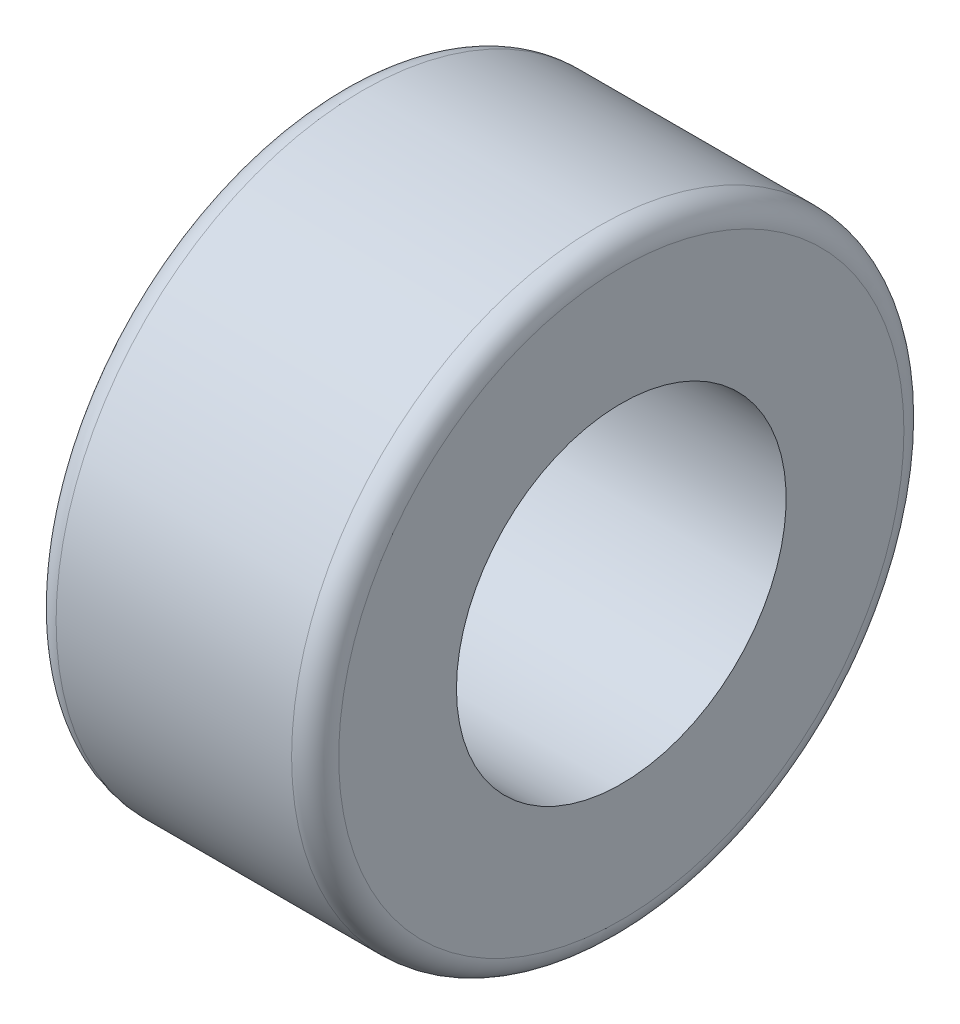
ISO-10303-21;
HEADER;
FILE_DESCRIPTION(('STEP AP214'),'2;1');
FILE_NAME('part.step','',(''),(''),'','','');
FILE_SCHEMA(('AUTOMOTIVE_DESIGN { 1 0 10303 214 1 1 1 1 }'));
ENDSEC;
DATA;
#1=APPLICATION_CONTEXT('core data for automotive mechanical design processes');
#2=APPLICATION_PROTOCOL_DEFINITION('international standard','automotive_design',2000,#1);
#3=PRODUCT_CONTEXT('',#1,'mechanical');
#4=PRODUCT('Part','Part','',(#3));
#5=PRODUCT_RELATED_PRODUCT_CATEGORY('part','',(#4));
#6=PRODUCT_DEFINITION_FORMATION('','',#4);
#7=PRODUCT_DEFINITION_CONTEXT('part definition',#1,'design');
#8=PRODUCT_DEFINITION('design','',#6,#7);
#9=PRODUCT_DEFINITION_SHAPE('','',#8);
#10=(LENGTH_UNIT() NAMED_UNIT(*) SI_UNIT(.MILLI.,.METRE.));
#11=(NAMED_UNIT(*) PLANE_ANGLE_UNIT() SI_UNIT($,.RADIAN.));
#12=(NAMED_UNIT(*) SI_UNIT($,.STERADIAN.) SOLID_ANGLE_UNIT());
#13=UNCERTAINTY_MEASURE_WITH_UNIT(LENGTH_MEASURE(1.E-05),#10,'distance_accuracy_value','');
#14=(GEOMETRIC_REPRESENTATION_CONTEXT(3) GLOBAL_UNCERTAINTY_ASSIGNED_CONTEXT((#13)) GLOBAL_UNIT_ASSIGNED_CONTEXT((#10,
#11,#12)) REPRESENTATION_CONTEXT('',''));
#15=CARTESIAN_POINT('',(0.,0.,0.));
#16=DIRECTION('',(0.,0.,1.));
#17=DIRECTION('',(1.,0.,0.));
#18=AXIS2_PLACEMENT_3D('',#15,#16,#17);
#19=CARTESIAN_POINT('',(152.4,0.,0.));
#20=DIRECTION('',(1.,0.,0.));
#21=DIRECTION('',(0.,0.,-1.));
#22=AXIS2_PLACEMENT_3D('',#19,#20,#21);
#23=PLANE('',#22);
#24=CARTESIAN_POINT('',(152.4,0.,0.));
#25=DIRECTION('',(1.,0.,0.));
#26=DIRECTION('',(0.,0.,-1.));
#27=AXIS2_PLACEMENT_3D('',#24,#25,#26);
#28=CIRCLE('',#27,152.4);
#29=CARTESIAN_POINT('',(152.4,0.,-152.4));
#30=VERTEX_POINT('',#29);
#31=EDGE_CURVE('E57',#30,#30,#28,.T.);
#32=ORIENTED_EDGE('',*,*,#31,.T.);
#33=EDGE_LOOP('',(#32));
#34=FACE_BOUND('',#33,.T.);
#35=CARTESIAN_POINT('',(152.4,0.,0.));
#36=DIRECTION('',(1.,0.,0.));
#37=DIRECTION('',(0.,0.,-1.));
#38=AXIS2_PLACEMENT_3D('',#35,#36,#37);
#39=CIRCLE('',#38,88.9);
#40=CARTESIAN_POINT('',(152.4,0.,88.9));
#41=VERTEX_POINT('',#40);
#42=EDGE_CURVE('E85',#41,#41,#39,.T.);
#43=ORIENTED_EDGE('',*,*,#42,.F.);
#44=EDGE_LOOP('',(#43));
#45=FACE_BOUND('',#44,.T.);
#46=ADVANCED_FACE('F38',(#34,#45),#23,.T.);
#47=CARTESIAN_POINT('',(0.,0.,0.));
#48=DIRECTION('',(1.,0.,0.));
#49=DIRECTION('',(0.,0.,-1.));
#50=AXIS2_PLACEMENT_3D('',#47,#48,#49);
#51=PLANE('',#50);
#52=CARTESIAN_POINT('',(0.,0.,0.));
#53=DIRECTION('',(1.,0.,0.));
#54=DIRECTION('',(0.,0.,-1.));
#55=AXIS2_PLACEMENT_3D('',#52,#53,#54);
#56=CIRCLE('',#55,152.4);
#57=CARTESIAN_POINT('',(0.,0.,-152.4));
#58=VERTEX_POINT('',#57);
#59=EDGE_CURVE('E69',#58,#58,#56,.F.);
#60=ORIENTED_EDGE('',*,*,#59,.T.);
#61=EDGE_LOOP('',(#60));
#62=FACE_BOUND('',#61,.T.);
#63=CARTESIAN_POINT('',(0.,0.,0.));
#64=DIRECTION('',(1.,0.,0.));
#65=DIRECTION('',(0.,0.,-1.));
#66=AXIS2_PLACEMENT_3D('',#63,#64,#65);
#67=CIRCLE('',#66,88.9);
#68=CARTESIAN_POINT('',(0.,0.,88.9));
#69=VERTEX_POINT('',#68);
#70=EDGE_CURVE('E86',#69,#69,#67,.T.);
#71=ORIENTED_EDGE('',*,*,#70,.T.);
#72=EDGE_LOOP('',(#71));
#73=FACE_BOUND('',#72,.T.);
#74=ADVANCED_FACE('F98',(#62,#73),#51,.F.);
#75=CARTESIAN_POINT('',(152.4,0.,0.));
#76=DIRECTION('',(-1.,0.,0.));
#77=DIRECTION('',(0.,0.,1.));
#78=AXIS2_PLACEMENT_3D('',#75,#76,#77);
#79=CYLINDRICAL_SURFACE('',#78,165.1);
#80=CARTESIAN_POINT('',(12.7,0.,0.));
#81=DIRECTION('',(1.,0.,0.));
#82=DIRECTION('',(0.,0.,-1.));
#83=AXIS2_PLACEMENT_3D('',#80,#81,#82);
#84=CIRCLE('',#83,165.1);
#85=CARTESIAN_POINT('',(12.7,0.,165.1));
#86=VERTEX_POINT('',#85);
#87=EDGE_CURVE('E74',#86,#86,#84,.T.);
#88=CARTESIAN_POINT('',(139.7,0.,0.));
#89=DIRECTION('',(1.,0.,0.));
#90=DIRECTION('',(0.,0.,-1.));
#91=AXIS2_PLACEMENT_3D('',#88,#89,#90);
#92=CIRCLE('',#91,165.1);
#93=CARTESIAN_POINT('',(139.7,0.,165.1));
#94=VERTEX_POINT('',#93);
#95=EDGE_CURVE('E79',#94,#94,#92,.F.);
#96=CARTESIAN_POINT('',(12.7,0.,165.1));
#97=CARTESIAN_POINT('',(14.0229166666667,0.,165.1));
#98=CARTESIAN_POINT('',(15.3458333333333,0.,165.1));
#99=CARTESIAN_POINT('',(17.9916666666667,0.,165.1));
#100=CARTESIAN_POINT('',(19.3145833333333,0.,165.1));
#101=CARTESIAN_POINT('',(21.9604166666667,0.,165.1));
#102=CARTESIAN_POINT('',(23.2833333333333,0.,165.1));
#103=CARTESIAN_POINT('',(25.9291666666667,0.,165.1));
#104=CARTESIAN_POINT('',(27.2520833333333,0.,165.1));
#105=CARTESIAN_POINT('',(29.8979166666666,0.,165.1));
#106=CARTESIAN_POINT('',(31.2208333333333,0.,165.1));
#107=CARTESIAN_POINT('',(33.8666666666666,0.,165.1));
#108=CARTESIAN_POINT('',(35.1895833333333,0.,165.1));
#109=CARTESIAN_POINT('',(37.8354166666667,0.,165.1));
#110=CARTESIAN_POINT('',(39.1583333333333,0.,165.1));
#111=CARTESIAN_POINT('',(41.8041666666666,0.,165.1));
#112=CARTESIAN_POINT('',(43.1270833333333,0.,165.1));
#113=CARTESIAN_POINT('',(45.7729166666667,0.,165.1));
#114=CARTESIAN_POINT('',(47.0958333333333,0.,165.1));
#115=CARTESIAN_POINT('',(49.7416666666667,0.,165.1));
#116=CARTESIAN_POINT('',(51.0645833333333,0.,165.1));
#117=CARTESIAN_POINT('',(53.7104166666667,0.,165.1));
#118=CARTESIAN_POINT('',(55.0333333333333,0.,165.1));
#119=CARTESIAN_POINT('',(57.6791666666667,0.,165.1));
#120=CARTESIAN_POINT('',(59.0020833333333,0.,165.1));
#121=CARTESIAN_POINT('',(61.6479166666667,0.,165.1));
#122=CARTESIAN_POINT('',(62.9708333333333,0.,165.1));
#123=CARTESIAN_POINT('',(65.6166666666667,0.,165.1));
#124=CARTESIAN_POINT('',(66.9395833333333,0.,165.1));
#125=CARTESIAN_POINT('',(69.5854166666667,0.,165.1));
#126=CARTESIAN_POINT('',(70.9083333333333,0.,165.1));
#127=CARTESIAN_POINT('',(73.5541666666667,0.,165.1));
#128=CARTESIAN_POINT('',(74.8770833333333,0.,165.1));
#129=CARTESIAN_POINT('',(77.5229166666667,0.,165.1));
#130=CARTESIAN_POINT('',(78.8458333333333,0.,165.1));
#131=CARTESIAN_POINT('',(81.4916666666667,0.,165.1));
#132=CARTESIAN_POINT('',(82.8145833333333,0.,165.1));
#133=CARTESIAN_POINT('',(85.4604166666667,0.,165.1));
#134=CARTESIAN_POINT('',(86.7833333333333,0.,165.1));
#135=CARTESIAN_POINT('',(89.4291666666667,0.,165.1));
#136=CARTESIAN_POINT('',(90.7520833333333,0.,165.1));
#137=CARTESIAN_POINT('',(93.3979166666667,0.,165.1));
#138=CARTESIAN_POINT('',(94.7208333333333,0.,165.1));
#139=CARTESIAN_POINT('',(97.3666666666667,0.,165.1));
#140=CARTESIAN_POINT('',(98.6895833333333,0.,165.1));
#141=CARTESIAN_POINT('',(101.335416666667,0.,165.1));
#142=CARTESIAN_POINT('',(102.658333333333,0.,165.1));
#143=CARTESIAN_POINT('',(105.304166666667,0.,165.1));
#144=CARTESIAN_POINT('',(106.627083333333,0.,165.1));
#145=CARTESIAN_POINT('',(109.272916666667,0.,165.1));
#146=CARTESIAN_POINT('',(110.595833333333,0.,165.1));
#147=CARTESIAN_POINT('',(113.241666666667,0.,165.1));
#148=CARTESIAN_POINT('',(114.564583333333,0.,165.1));
#149=CARTESIAN_POINT('',(117.210416666667,0.,165.1));
#150=CARTESIAN_POINT('',(118.533333333333,0.,165.1));
#151=CARTESIAN_POINT('',(121.179166666667,0.,165.1));
#152=CARTESIAN_POINT('',(122.502083333333,0.,165.1));
#153=CARTESIAN_POINT('',(125.147916666667,0.,165.1));
#154=CARTESIAN_POINT('',(126.470833333333,0.,165.1));
#155=CARTESIAN_POINT('',(129.116666666667,0.,165.1));
#156=CARTESIAN_POINT('',(130.439583333333,0.,165.1));
#157=CARTESIAN_POINT('',(133.085416666667,0.,165.1));
#158=CARTESIAN_POINT('',(134.408333333333,0.,165.1));
#159=CARTESIAN_POINT('',(137.054166666667,0.,165.1));
#160=CARTESIAN_POINT('',(138.377083333333,0.,165.1));
#161=CARTESIAN_POINT('',(139.7,0.,165.1));
#162=B_SPLINE_CURVE_WITH_KNOTS('',3,(#96,#97,#98,#99,#100,#101,#102,#103,#104,#105,#106,#107,
#108,#109,#110,#111,#112,#113,#114,#115,#116,#117,#118,#119,#120,#121,#122,#123,#124,#125,#126,
#127,#128,#129,#130,#131,#132,#133,#134,#135,#136,#137,#138,#139,#140,#141,#142,#143,#144,#145,
#146,#147,#148,#149,#150,#151,#152,#153,#154,#155,#156,#157,#158,#159,#160,#161),.UNSPECIFIED.,
.F.,.F.,(4,2,2,2,2,2,2,2,2,2,2,2,2,2,2,2,2,2,2,2,2,2,2,2,2,2,2,2,2,2,2,2,4),(0.,
3.96874999999999,7.93750000000001,11.90625,15.875,19.84375,23.8125,27.78125,31.75,35.71875,
39.6875,43.65625,47.625,51.59375,55.5625,59.53125,63.5,67.46875,71.4375,75.40625,79.375,
83.34375,87.3125,91.28125,95.25,99.21875,103.1875,107.15625,111.125,115.09375,119.0625,
123.03125,127.),.UNSPECIFIED.);
#163=EDGE_CURVE('BSEAM103',#86,#94,#162,.T.);
#164=ORIENTED_EDGE('',*,*,#87,.T.);
#165=ORIENTED_EDGE('',*,*,#95,.T.);
#166=ORIENTED_EDGE('',*,*,#163,.T.);
#167=ORIENTED_EDGE('',*,*,#163,.F.);
#168=EDGE_LOOP('',(#164,#166,#165,#167));
#169=FACE_BOUND('',#168,.T.);
#170=ADVANCED_FACE('F103',(#169),#79,.T.);
#171=CARTESIAN_POINT('',(152.4,0.,0.));
#172=DIRECTION('',(-1.,0.,0.));
#173=DIRECTION('',(0.,0.,1.));
#174=AXIS2_PLACEMENT_3D('',#171,#172,#173);
#175=CYLINDRICAL_SURFACE('',#174,88.9);
#176=CARTESIAN_POINT('',(152.4,0.,88.9));
#177=CARTESIAN_POINT('',(150.8125,0.,88.9));
#178=CARTESIAN_POINT('',(149.225,0.,88.9));
#179=CARTESIAN_POINT('',(146.05,0.,88.9));
#180=CARTESIAN_POINT('',(144.4625,0.,88.9));
#181=CARTESIAN_POINT('',(141.2875,0.,88.9));
#182=CARTESIAN_POINT('',(139.7,0.,88.9));
#183=CARTESIAN_POINT('',(136.525,0.,88.9));
#184=CARTESIAN_POINT('',(134.9375,0.,88.9));
#185=CARTESIAN_POINT('',(131.7625,0.,88.9));
#186=CARTESIAN_POINT('',(130.175,0.,88.9));
#187=CARTESIAN_POINT('',(127.,0.,88.9));
#188=CARTESIAN_POINT('',(125.4125,0.,88.9));
#189=CARTESIAN_POINT('',(122.2375,0.,88.9));
#190=CARTESIAN_POINT('',(120.65,0.,88.9));
#191=CARTESIAN_POINT('',(117.475,0.,88.9));
#192=CARTESIAN_POINT('',(115.8875,0.,88.9));
#193=CARTESIAN_POINT('',(112.7125,0.,88.9));
#194=CARTESIAN_POINT('',(111.125,0.,88.9));
#195=CARTESIAN_POINT('',(107.95,0.,88.9));
#196=CARTESIAN_POINT('',(106.3625,0.,88.9));
#197=CARTESIAN_POINT('',(103.1875,0.,88.9));
#198=CARTESIAN_POINT('',(101.6,0.,88.9));
#199=CARTESIAN_POINT('',(98.425,0.,88.9));
#200=CARTESIAN_POINT('',(96.8375,0.,88.9));
#201=CARTESIAN_POINT('',(93.6625,0.,88.9));
#202=CARTESIAN_POINT('',(92.075,0.,88.9));
#203=CARTESIAN_POINT('',(88.9,0.,88.9));
#204=CARTESIAN_POINT('',(87.3125,0.,88.9));
#205=CARTESIAN_POINT('',(84.1375,0.,88.9));
#206=CARTESIAN_POINT('',(82.55,0.,88.9));
#207=CARTESIAN_POINT('',(79.375,0.,88.9));
#208=CARTESIAN_POINT('',(77.7875,0.,88.9));
#209=CARTESIAN_POINT('',(74.6125,0.,88.9));
#210=CARTESIAN_POINT('',(73.025,0.,88.9));
#211=CARTESIAN_POINT('',(69.85,0.,88.9));
#212=CARTESIAN_POINT('',(68.2625,0.,88.9));
#213=CARTESIAN_POINT('',(65.0875,0.,88.9));
#214=CARTESIAN_POINT('',(63.5,0.,88.9));
#215=CARTESIAN_POINT('',(60.325,0.,88.9));
#216=CARTESIAN_POINT('',(58.7375,0.,88.9));
#217=CARTESIAN_POINT('',(55.5625,0.,88.9));
#218=CARTESIAN_POINT('',(53.975,0.,88.9));
#219=CARTESIAN_POINT('',(50.8,0.,88.9));
#220=CARTESIAN_POINT('',(49.2125,0.,88.9));
#221=CARTESIAN_POINT('',(46.0375,0.,88.9));
#222=CARTESIAN_POINT('',(44.45,0.,88.9));
#223=CARTESIAN_POINT('',(41.275,0.,88.9));
#224=CARTESIAN_POINT('',(39.6875,0.,88.9));
#225=CARTESIAN_POINT('',(36.5125,0.,88.9));
#226=CARTESIAN_POINT('',(34.925,0.,88.9));
#227=CARTESIAN_POINT('',(31.75,0.,88.9));
#228=CARTESIAN_POINT('',(30.1625,0.,88.9));
#229=CARTESIAN_POINT('',(26.9875,0.,88.9));
#230=CARTESIAN_POINT('',(25.4,0.,88.9));
#231=CARTESIAN_POINT('',(22.225,0.,88.9));
#232=CARTESIAN_POINT('',(20.6375,0.,88.9));
#233=CARTESIAN_POINT('',(17.4625,0.,88.9));
#234=CARTESIAN_POINT('',(15.875,0.,88.9));
#235=CARTESIAN_POINT('',(12.7,0.,88.9));
#236=CARTESIAN_POINT('',(11.1125,0.,88.9));
#237=CARTESIAN_POINT('',(7.93750000000001,0.,88.9));
#238=CARTESIAN_POINT('',(6.35,0.,88.9));
#239=CARTESIAN_POINT('',(3.175,0.,88.9));
#240=CARTESIAN_POINT('',(1.5875,0.,88.9));
#241=CARTESIAN_POINT('',(0.,0.,88.9));
#242=B_SPLINE_CURVE_WITH_KNOTS('',3,(#176,#177,#178,#179,#180,#181,#182,#183,#184,#185,#186,
#187,#188,#189,#190,#191,#192,#193,#194,#195,#196,#197,#198,#199,#200,#201,#202,#203,#204,#205,
#206,#207,#208,#209,#210,#211,#212,#213,#214,#215,#216,#217,#218,#219,#220,#221,#222,#223,#224,
#225,#226,#227,#228,#229,#230,#231,#232,#233,#234,#235,#236,#237,#238,#239,#240,#241),
.UNSPECIFIED.,.F.,.F.,(4,2,2,2,2,2,2,2,2,2,2,2,2,2,2,2,2,2,2,2,2,2,2,2,2,2,2,2,2,2,2,2,4),(0.,
4.7625,9.52500000000001,14.2875,19.05,23.8125,28.575,33.3375,38.1,42.8625,47.625,52.3875,57.15,
61.9125,66.675,71.4375,76.2,80.9625,85.725,90.4875,95.25,100.0125,104.775,109.5375,114.3,
119.0625,123.825,128.5875,133.35,138.1125,142.875,147.6375,152.4),.UNSPECIFIED.);
#243=EDGE_CURVE('BSEAM94',#41,#69,#242,.T.);
#244=ORIENTED_EDGE('',*,*,#42,.T.);
#245=ORIENTED_EDGE('',*,*,#70,.F.);
#246=ORIENTED_EDGE('',*,*,#243,.T.);
#247=ORIENTED_EDGE('',*,*,#243,.F.);
#248=EDGE_LOOP('',(#244,#246,#245,#247));
#249=FACE_BOUND('',#248,.T.);
#250=ADVANCED_FACE('F94',(#249),#175,.F.);
#251=CARTESIAN_POINT('',(12.7,0.,0.));
#252=DIRECTION('',(1.,0.,0.));
#253=DIRECTION('',(0.,0.,-1.));
#254=AXIS2_PLACEMENT_3D('',#251,#252,#253);
#255=TOROIDAL_SURFACE('',#254,152.4,12.7);
#256=ORIENTED_EDGE('',*,*,#59,.F.);
#257=EDGE_LOOP('',(#256));
#258=FACE_BOUND('',#257,.T.);
#259=ORIENTED_EDGE('',*,*,#87,.F.);
#260=EDGE_LOOP('',(#259));
#261=FACE_BOUND('',#260,.T.);
#262=ADVANCED_FACE('F110',(#258,#261),#255,.T.);
#263=CARTESIAN_POINT('',(139.7,0.,0.));
#264=DIRECTION('',(1.,0.,0.));
#265=DIRECTION('',(0.,0.,-1.));
#266=AXIS2_PLACEMENT_3D('',#263,#264,#265);
#267=TOROIDAL_SURFACE('',#266,152.4,12.7);
#268=ORIENTED_EDGE('',*,*,#95,.F.);
#269=EDGE_LOOP('',(#268));
#270=FACE_BOUND('',#269,.T.);
#271=ORIENTED_EDGE('',*,*,#31,.F.);
#272=EDGE_LOOP('',(#271));
#273=FACE_BOUND('',#272,.T.);
#274=ADVANCED_FACE('F113',(#270,#273),#267,.T.);
#275=CLOSED_SHELL('',(#46,#74,#170,#250,#262,#274));
#276=CARTESIAN_POINT('',(139.7,0.,0.));
#277=DIRECTION('',(1.,0.,0.));
#278=DIRECTION('',(0.,0.,-1.));
#279=AXIS2_PLACEMENT_3D('',#276,#277,#278);
#280=PLANE('',#279);
#281=CARTESIAN_POINT('',(139.7,0.,0.));
#282=DIRECTION('',(1.,0.,0.));
#283=DIRECTION('',(0.,0.,-1.));
#284=AXIS2_PLACEMENT_3D('',#281,#282,#283);
#285=CIRCLE('',#284,152.4);
#286=CARTESIAN_POINT('',(139.7,0.,152.4));
#287=VERTEX_POINT('',#286);
#288=EDGE_CURVE('E42',#287,#287,#285,.T.);
#289=ORIENTED_EDGE('',*,*,#288,.F.);
#290=EDGE_LOOP('',(#289));
#291=FACE_BOUND('',#290,.T.);
#292=CARTESIAN_POINT('',(139.7,0.,0.));
#293=DIRECTION('',(1.,0.,0.));
#294=DIRECTION('',(0.,0.,-1.));
#295=AXIS2_PLACEMENT_3D('',#292,#293,#294);
#296=CIRCLE('',#295,101.6);
#297=CARTESIAN_POINT('',(139.7,0.,101.6));
#298=VERTEX_POINT('',#297);
#299=EDGE_CURVE('E10',#298,#298,#296,.T.);
#300=ORIENTED_EDGE('',*,*,#299,.T.);
#301=EDGE_LOOP('',(#300));
#302=FACE_BOUND('',#301,.T.);
#303=ADVANCED_FACE('F118',(#291,#302),#280,.F.);
#304=CARTESIAN_POINT('',(12.7,0.,0.));
#305=DIRECTION('',(1.,0.,0.));
#306=DIRECTION('',(0.,0.,-1.));
#307=AXIS2_PLACEMENT_3D('',#304,#305,#306);
#308=PLANE('',#307);
#309=CARTESIAN_POINT('',(12.7,0.,0.));
#310=DIRECTION('',(1.,0.,0.));
#311=DIRECTION('',(0.,0.,-1.));
#312=AXIS2_PLACEMENT_3D('',#309,#310,#311);
#313=CIRCLE('',#312,152.4);
#314=CARTESIAN_POINT('',(12.7,0.,152.4));
#315=VERTEX_POINT('',#314);
#316=EDGE_CURVE('E48',#315,#315,#313,.T.);
#317=ORIENTED_EDGE('',*,*,#316,.T.);
#318=EDGE_LOOP('',(#317));
#319=FACE_BOUND('',#318,.T.);
#320=CARTESIAN_POINT('',(12.7,0.,0.));
#321=DIRECTION('',(1.,0.,0.));
#322=DIRECTION('',(0.,0.,-1.));
#323=AXIS2_PLACEMENT_3D('',#320,#321,#322);
#324=CIRCLE('',#323,101.6);
#325=CARTESIAN_POINT('',(12.7,0.,101.6));
#326=VERTEX_POINT('',#325);
#327=EDGE_CURVE('E54',#326,#326,#324,.T.);
#328=ORIENTED_EDGE('',*,*,#327,.F.);
#329=EDGE_LOOP('',(#328));
#330=FACE_BOUND('',#329,.T.);
#331=ADVANCED_FACE('F121',(#319,#330),#308,.T.);
#332=CARTESIAN_POINT('',(152.4,0.,0.));
#333=DIRECTION('',(-1.,0.,0.));
#334=DIRECTION('',(0.,0.,1.));
#335=AXIS2_PLACEMENT_3D('',#332,#333,#334);
#336=CYLINDRICAL_SURFACE('',#335,152.4);
#337=CARTESIAN_POINT('',(12.7,0.,152.4));
#338=CARTESIAN_POINT('',(14.0229166666667,0.,152.4));
#339=CARTESIAN_POINT('',(15.3458333333333,0.,152.4));
#340=CARTESIAN_POINT('',(17.9916666666667,0.,152.4));
#341=CARTESIAN_POINT('',(19.3145833333333,0.,152.4));
#342=CARTESIAN_POINT('',(21.9604166666667,0.,152.4));
#343=CARTESIAN_POINT('',(23.2833333333333,0.,152.4));
#344=CARTESIAN_POINT('',(25.9291666666667,0.,152.4));
#345=CARTESIAN_POINT('',(27.2520833333333,0.,152.4));
#346=CARTESIAN_POINT('',(29.8979166666666,0.,152.4));
#347=CARTESIAN_POINT('',(31.2208333333333,0.,152.4));
#348=CARTESIAN_POINT('',(33.8666666666666,0.,152.4));
#349=CARTESIAN_POINT('',(35.1895833333333,0.,152.4));
#350=CARTESIAN_POINT('',(37.8354166666667,0.,152.4));
#351=CARTESIAN_POINT('',(39.1583333333333,0.,152.4));
#352=CARTESIAN_POINT('',(41.8041666666666,0.,152.4));
#353=CARTESIAN_POINT('',(43.1270833333333,0.,152.4));
#354=CARTESIAN_POINT('',(45.7729166666667,0.,152.4));
#355=CARTESIAN_POINT('',(47.0958333333333,0.,152.4));
#356=CARTESIAN_POINT('',(49.7416666666667,0.,152.4));
#357=CARTESIAN_POINT('',(51.0645833333333,0.,152.4));
#358=CARTESIAN_POINT('',(53.7104166666667,0.,152.4));
#359=CARTESIAN_POINT('',(55.0333333333333,0.,152.4));
#360=CARTESIAN_POINT('',(57.6791666666667,0.,152.4));
#361=CARTESIAN_POINT('',(59.0020833333333,0.,152.4));
#362=CARTESIAN_POINT('',(61.6479166666667,0.,152.4));
#363=CARTESIAN_POINT('',(62.9708333333333,0.,152.4));
#364=CARTESIAN_POINT('',(65.6166666666667,0.,152.4));
#365=CARTESIAN_POINT('',(66.9395833333333,0.,152.4));
#366=CARTESIAN_POINT('',(69.5854166666667,0.,152.4));
#367=CARTESIAN_POINT('',(70.9083333333333,0.,152.4));
#368=CARTESIAN_POINT('',(73.5541666666667,0.,152.4));
#369=CARTESIAN_POINT('',(74.8770833333333,0.,152.4));
#370=CARTESIAN_POINT('',(77.5229166666667,0.,152.4));
#371=CARTESIAN_POINT('',(78.8458333333333,0.,152.4));
#372=CARTESIAN_POINT('',(81.4916666666667,0.,152.4));
#373=CARTESIAN_POINT('',(82.8145833333333,0.,152.4));
#374=CARTESIAN_POINT('',(85.4604166666667,0.,152.4));
#375=CARTESIAN_POINT('',(86.7833333333333,0.,152.4));
#376=CARTESIAN_POINT('',(89.4291666666667,0.,152.4));
#377=CARTESIAN_POINT('',(90.7520833333333,0.,152.4));
#378=CARTESIAN_POINT('',(93.3979166666667,0.,152.4));
#379=CARTESIAN_POINT('',(94.7208333333333,0.,152.4));
#380=CARTESIAN_POINT('',(97.3666666666667,0.,152.4));
#381=CARTESIAN_POINT('',(98.6895833333333,0.,152.4));
#382=CARTESIAN_POINT('',(101.335416666667,0.,152.4));
#383=CARTESIAN_POINT('',(102.658333333333,0.,152.4));
#384=CARTESIAN_POINT('',(105.304166666667,0.,152.4));
#385=CARTESIAN_POINT('',(106.627083333333,0.,152.4));
#386=CARTESIAN_POINT('',(109.272916666667,0.,152.4));
#387=CARTESIAN_POINT('',(110.595833333333,0.,152.4));
#388=CARTESIAN_POINT('',(113.241666666667,0.,152.4));
#389=CARTESIAN_POINT('',(114.564583333333,0.,152.4));
#390=CARTESIAN_POINT('',(117.210416666667,0.,152.4));
#391=CARTESIAN_POINT('',(118.533333333333,0.,152.4));
#392=CARTESIAN_POINT('',(121.179166666667,0.,152.4));
#393=CARTESIAN_POINT('',(122.502083333333,0.,152.4));
#394=CARTESIAN_POINT('',(125.147916666667,0.,152.4));
#395=CARTESIAN_POINT('',(126.470833333333,0.,152.4));
#396=CARTESIAN_POINT('',(129.116666666667,0.,152.4));
#397=CARTESIAN_POINT('',(130.439583333333,0.,152.4));
#398=CARTESIAN_POINT('',(133.085416666667,0.,152.4));
#399=CARTESIAN_POINT('',(134.408333333333,0.,152.4));
#400=CARTESIAN_POINT('',(137.054166666667,0.,152.4));
#401=CARTESIAN_POINT('',(138.377083333333,0.,152.4));
#402=CARTESIAN_POINT('',(139.7,0.,152.4));
#403=B_SPLINE_CURVE_WITH_KNOTS('',3,(#337,#338,#339,#340,#341,#342,#343,#344,#345,#346,#347,
#348,#349,#350,#351,#352,#353,#354,#355,#356,#357,#358,#359,#360,#361,#362,#363,#364,#365,#366,
#367,#368,#369,#370,#371,#372,#373,#374,#375,#376,#377,#378,#379,#380,#381,#382,#383,#384,#385,
#386,#387,#388,#389,#390,#391,#392,#393,#394,#395,#396,#397,#398,#399,#400,#401,#402),
.UNSPECIFIED.,.F.,.F.,(4,2,2,2,2,2,2,2,2,2,2,2,2,2,2,2,2,2,2,2,2,2,2,2,2,2,2,2,2,2,2,2,4),(0.,
3.96874999999999,7.93750000000001,11.90625,15.875,19.84375,23.8125,27.78125,31.75,35.71875,
39.6875,43.65625,47.625,51.59375,55.5625,59.53125,63.5,67.46875,71.4375,75.40625,79.375,
83.34375,87.3125,91.28125,95.25,99.21875,103.1875,107.15625,111.125,115.09375,119.0625,
123.03125,127.),.UNSPECIFIED.);
#404=EDGE_CURVE('BSEAM125',#315,#287,#403,.T.);
#405=ORIENTED_EDGE('',*,*,#316,.F.);
#406=ORIENTED_EDGE('',*,*,#288,.T.);
#407=ORIENTED_EDGE('',*,*,#404,.T.);
#408=ORIENTED_EDGE('',*,*,#404,.F.);
#409=EDGE_LOOP('',(#405,#407,#406,#408));
#410=FACE_BOUND('',#409,.T.);
#411=ADVANCED_FACE('F125',(#410),#336,.F.);
#412=CARTESIAN_POINT('',(152.4,0.,0.));
#413=DIRECTION('',(-1.,0.,0.));
#414=DIRECTION('',(0.,0.,1.));
#415=AXIS2_PLACEMENT_3D('',#412,#413,#414);
#416=CYLINDRICAL_SURFACE('',#415,101.6);
#417=CARTESIAN_POINT('',(139.7,0.,101.6));
#418=CARTESIAN_POINT('',(138.377083333333,0.,101.6));
#419=CARTESIAN_POINT('',(137.054166666667,0.,101.6));
#420=CARTESIAN_POINT('',(134.408333333333,0.,101.6));
#421=CARTESIAN_POINT('',(133.085416666667,0.,101.6));
#422=CARTESIAN_POINT('',(130.439583333333,0.,101.6));
#423=CARTESIAN_POINT('',(129.116666666667,0.,101.6));
#424=CARTESIAN_POINT('',(126.470833333333,0.,101.6));
#425=CARTESIAN_POINT('',(125.147916666667,0.,101.6));
#426=CARTESIAN_POINT('',(122.502083333333,0.,101.6));
#427=CARTESIAN_POINT('',(121.179166666667,0.,101.6));
#428=CARTESIAN_POINT('',(118.533333333333,0.,101.6));
#429=CARTESIAN_POINT('',(117.210416666667,0.,101.6));
#430=CARTESIAN_POINT('',(114.564583333333,0.,101.6));
#431=CARTESIAN_POINT('',(113.241666666667,0.,101.6));
#432=CARTESIAN_POINT('',(110.595833333333,0.,101.6));
#433=CARTESIAN_POINT('',(109.272916666667,0.,101.6));
#434=CARTESIAN_POINT('',(106.627083333333,0.,101.6));
#435=CARTESIAN_POINT('',(105.304166666667,0.,101.6));
#436=CARTESIAN_POINT('',(102.658333333333,0.,101.6));
#437=CARTESIAN_POINT('',(101.335416666667,0.,101.6));
#438=CARTESIAN_POINT('',(98.6895833333333,0.,101.6));
#439=CARTESIAN_POINT('',(97.3666666666667,0.,101.6));
#440=CARTESIAN_POINT('',(94.7208333333333,0.,101.6));
#441=CARTESIAN_POINT('',(93.3979166666666,0.,101.6));
#442=CARTESIAN_POINT('',(90.7520833333333,0.,101.6));
#443=CARTESIAN_POINT('',(89.4291666666667,0.,101.6));
#444=CARTESIAN_POINT('',(86.7833333333333,0.,101.6));
#445=CARTESIAN_POINT('',(85.4604166666667,0.,101.6));
#446=CARTESIAN_POINT('',(82.8145833333333,0.,101.6));
#447=CARTESIAN_POINT('',(81.4916666666667,0.,101.6));
#448=CARTESIAN_POINT('',(78.8458333333333,0.,101.6));
#449=CARTESIAN_POINT('',(77.5229166666667,0.,101.6));
#450=CARTESIAN_POINT('',(74.8770833333333,0.,101.6));
#451=CARTESIAN_POINT('',(73.5541666666667,0.,101.6));
#452=CARTESIAN_POINT('',(70.9083333333333,0.,101.6));
#453=CARTESIAN_POINT('',(69.5854166666666,0.,101.6));
#454=CARTESIAN_POINT('',(66.9395833333333,0.,101.6));
#455=CARTESIAN_POINT('',(65.6166666666667,0.,101.6));
#456=CARTESIAN_POINT('',(62.9708333333333,0.,101.6));
#457=CARTESIAN_POINT('',(61.6479166666667,0.,101.6));
#458=CARTESIAN_POINT('',(59.0020833333333,0.,101.6));
#459=CARTESIAN_POINT('',(57.6791666666667,0.,101.6));
#460=CARTESIAN_POINT('',(55.0333333333333,0.,101.6));
#461=CARTESIAN_POINT('',(53.7104166666666,0.,101.6));
#462=CARTESIAN_POINT('',(51.0645833333333,0.,101.6));
#463=CARTESIAN_POINT('',(49.7416666666666,0.,101.6));
#464=CARTESIAN_POINT('',(47.0958333333333,0.,101.6));
#465=CARTESIAN_POINT('',(45.7729166666666,0.,101.6));
#466=CARTESIAN_POINT('',(43.1270833333333,0.,101.6));
#467=CARTESIAN_POINT('',(41.8041666666666,0.,101.6));
#468=CARTESIAN_POINT('',(39.1583333333333,0.,101.6));
#469=CARTESIAN_POINT('',(37.8354166666666,0.,101.6));
#470=CARTESIAN_POINT('',(35.1895833333333,0.,101.6));
#471=CARTESIAN_POINT('',(33.8666666666666,0.,101.6));
#472=CARTESIAN_POINT('',(31.2208333333333,0.,101.6));
#473=CARTESIAN_POINT('',(29.8979166666666,0.,101.6));
#474=CARTESIAN_POINT('',(27.2520833333333,0.,101.6));
#475=CARTESIAN_POINT('',(25.9291666666667,0.,101.6));
#476=CARTESIAN_POINT('',(23.2833333333333,0.,101.6));
#477=CARTESIAN_POINT('',(21.9604166666666,0.,101.6));
#478=CARTESIAN_POINT('',(19.3145833333333,0.,101.6));
#479=CARTESIAN_POINT('',(17.9916666666666,0.,101.6));
#480=CARTESIAN_POINT('',(15.3458333333333,0.,101.6));
#481=CARTESIAN_POINT('',(14.0229166666667,0.,101.6));
#482=CARTESIAN_POINT('',(12.7,0.,101.6));
#483=B_SPLINE_CURVE_WITH_KNOTS('',3,(#417,#418,#419,#420,#421,#422,#423,#424,#425,#426,#427,
#428,#429,#430,#431,#432,#433,#434,#435,#436,#437,#438,#439,#440,#441,#442,#443,#444,#445,#446,
#447,#448,#449,#450,#451,#452,#453,#454,#455,#456,#457,#458,#459,#460,#461,#462,#463,#464,#465,
#466,#467,#468,#469,#470,#471,#472,#473,#474,#475,#476,#477,#478,#479,#480,#481,#482),
.UNSPECIFIED.,.F.,.F.,(4,2,2,2,2,2,2,2,2,2,2,2,2,2,2,2,2,2,2,2,2,2,2,2,2,2,2,2,2,2,2,2,4),(0.,
3.96875000000002,7.93750000000001,11.90625,15.875,19.84375,23.8125,27.78125,31.75,35.71875,
39.6875,43.65625,47.625,51.59375,55.5625,59.53125,63.5,67.46875,71.4375,75.40625,79.375,
83.34375,87.3125,91.28125,95.25,99.2187500000001,103.1875,107.15625,111.125,115.09375,119.0625,
123.03125,127.),.UNSPECIFIED.);
#484=EDGE_CURVE('BSEAM40',#298,#326,#483,.T.);
#485=ORIENTED_EDGE('',*,*,#299,.F.);
#486=ORIENTED_EDGE('',*,*,#327,.T.);
#487=ORIENTED_EDGE('',*,*,#484,.T.);
#488=ORIENTED_EDGE('',*,*,#484,.F.);
#489=EDGE_LOOP('',(#485,#487,#486,#488));
#490=FACE_BOUND('',#489,.T.);
#491=ADVANCED_FACE('F40',(#490),#416,.T.);
#492=CLOSED_SHELL('',(#303,#331,#411,#491));
#493=ORIENTED_CLOSED_SHELL('',*,#492,.T.);
#494=BREP_WITH_VOIDS('B2',#275,(#493));
#495=ADVANCED_BREP_SHAPE_REPRESENTATION('',(#18,#494),#14);
#496=SHAPE_DEFINITION_REPRESENTATION(#9,#495);
ENDSEC;
END-ISO-10303-21;
